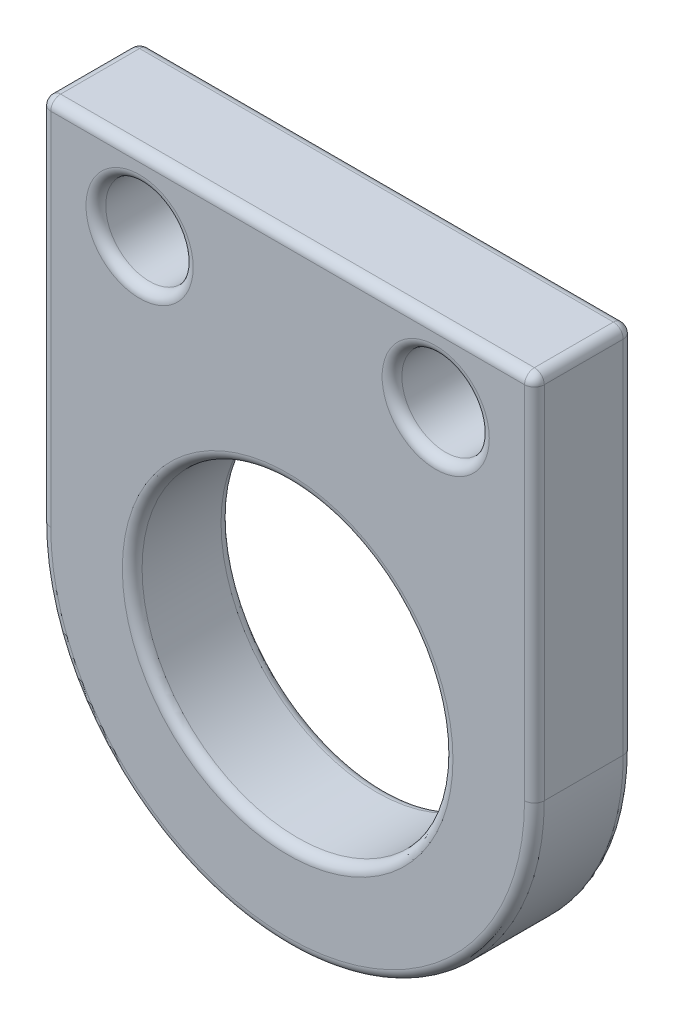
ISO-10303-21;
HEADER;
FILE_DESCRIPTION(('STEP AP214'),'2;1');
FILE_NAME('part.step','',(''),(''),'','','');
FILE_SCHEMA(('AUTOMOTIVE_DESIGN { 1 0 10303 214 1 1 1 1 }'));
ENDSEC;
DATA;
#1=APPLICATION_CONTEXT('core data for automotive mechanical design processes');
#2=APPLICATION_PROTOCOL_DEFINITION('international standard','automotive_design',2000,#1);
#3=PRODUCT_CONTEXT('',#1,'mechanical');
#4=PRODUCT('Part','Part','',(#3));
#5=PRODUCT_RELATED_PRODUCT_CATEGORY('part','',(#4));
#6=PRODUCT_DEFINITION_FORMATION('','',#4);
#7=PRODUCT_DEFINITION_CONTEXT('part definition',#1,'design');
#8=PRODUCT_DEFINITION('design','',#6,#7);
#9=PRODUCT_DEFINITION_SHAPE('','',#8);
#10=(LENGTH_UNIT() NAMED_UNIT(*) SI_UNIT(.MILLI.,.METRE.));
#11=(NAMED_UNIT(*) PLANE_ANGLE_UNIT() SI_UNIT($,.RADIAN.));
#12=(NAMED_UNIT(*) SI_UNIT($,.STERADIAN.) SOLID_ANGLE_UNIT());
#13=UNCERTAINTY_MEASURE_WITH_UNIT(LENGTH_MEASURE(1.E-05),#10,'distance_accuracy_value','');
#14=(GEOMETRIC_REPRESENTATION_CONTEXT(3) GLOBAL_UNCERTAINTY_ASSIGNED_CONTEXT((#13)) GLOBAL_UNIT_ASSIGNED_CONTEXT((#10,
#11,#12)) REPRESENTATION_CONTEXT('',''));
#15=CARTESIAN_POINT('',(0.,0.,0.));
#16=DIRECTION('',(0.,0.,1.));
#17=DIRECTION('',(1.,0.,0.));
#18=AXIS2_PLACEMENT_3D('',#15,#16,#17);
#19=CARTESIAN_POINT('',(-2743.81641052747,-3469.16156066705,-5098.24265194393));
#20=DIRECTION('',(-1.,0.,0.));
#21=DIRECTION('',(0.,0.,1.));
#22=AXIS2_PLACEMENT_3D('',#19,#20,#21);
#23=PLANE('',#22);
#24=DIRECTION('',(0.,0.,-1.));
#25=VECTOR('',#24,1.);
#26=CARTESIAN_POINT('',(-2743.81641052747,-3459.89056066705,-5098.24265194393));
#27=LINE('',#26,#25);
#28=CARTESIAN_POINT('',(-2743.81641052747,-3459.89056066705,-5100.52865194393));
#29=VERTEX_POINT('',#28);
#30=CARTESIAN_POINT('',(-2743.81641052747,-3459.89056066705,-5098.49665194393));
#31=VERTEX_POINT('',#30);
#32=EDGE_CURVE('E129',#29,#31,#27,.F.);
#33=ORIENTED_EDGE('',*,*,#32,.T.);
#34=DIRECTION('',(0.,1.,0.));
#35=VECTOR('',#34,1.);
#36=CARTESIAN_POINT('',(-2743.81641052747,-3469.16156066705,-5098.49665194393));
#37=LINE('',#36,#35);
#38=CARTESIAN_POINT('',(-2743.81641052747,-3469.16156066705,-5098.49665194393));
#39=VERTEX_POINT('',#38);
#40=EDGE_CURVE('E173',#31,#39,#37,.F.);
#41=ORIENTED_EDGE('',*,*,#40,.T.);
#42=DIRECTION('',(0.,0.,-1.));
#43=VECTOR('',#42,1.);
#44=CARTESIAN_POINT('',(-2743.81641052747,-3469.16156066705,-5098.24265194393));
#45=LINE('',#44,#43);
#46=CARTESIAN_POINT('',(-2743.81641052747,-3469.16156066705,-5100.52865194393));
#47=VERTEX_POINT('',#46);
#48=EDGE_CURVE('E307',#39,#47,#45,.T.);
#49=ORIENTED_EDGE('',*,*,#48,.T.);
#50=DIRECTION('',(0.,1.,0.));
#51=VECTOR('',#50,1.);
#52=CARTESIAN_POINT('',(-2743.81641052747,-3469.16156066705,-5100.52865194393));
#53=LINE('',#52,#51);
#54=EDGE_CURVE('E165',#47,#29,#53,.T.);
#55=ORIENTED_EDGE('',*,*,#54,.T.);
#56=EDGE_LOOP('',(#33,#41,#49,#55));
#57=FACE_BOUND('',#56,.T.);
#58=ADVANCED_FACE('F45',(#57),#23,.F.);
#59=CARTESIAN_POINT('',(-2756.51641052747,-3459.63656066705,-5098.24265194393));
#60=DIRECTION('',(0.,-1.,0.));
#61=DIRECTION('',(0.,0.,-1.));
#62=AXIS2_PLACEMENT_3D('',#59,#60,#61);
#63=PLANE('',#62);
#64=DIRECTION('',(0.,0.,-1.));
#65=VECTOR('',#64,1.);
#66=CARTESIAN_POINT('',(-2756.26241052747,-3459.63656066705,-5098.24265194393));
#67=LINE('',#66,#65);
#68=CARTESIAN_POINT('',(-2756.26241052747,-3459.63656066705,-5100.52865194393));
#69=VERTEX_POINT('',#68);
#70=CARTESIAN_POINT('',(-2756.26241052747,-3459.63656066705,-5098.49665194393));
#71=VERTEX_POINT('',#70);
#72=EDGE_CURVE('E154',#69,#71,#67,.F.);
#73=ORIENTED_EDGE('',*,*,#72,.T.);
#74=DIRECTION('',(-1.,0.,0.));
#75=VECTOR('',#74,1.);
#76=CARTESIAN_POINT('',(-2743.81641052747,-3459.63656066705,-5098.49665194393));
#77=LINE('',#76,#75);
#78=CARTESIAN_POINT('',(-2744.07041052747,-3459.63656066705,-5098.49665194393));
#79=VERTEX_POINT('',#78);
#80=EDGE_CURVE('E159',#71,#79,#77,.F.);
#81=ORIENTED_EDGE('',*,*,#80,.T.);
#82=DIRECTION('',(0.,0.,-1.));
#83=VECTOR('',#82,1.);
#84=CARTESIAN_POINT('',(-2744.07041052747,-3459.63656066705,-5098.24265194393));
#85=LINE('',#84,#83);
#86=CARTESIAN_POINT('',(-2744.07041052747,-3459.63656066705,-5100.52865194393));
#87=VERTEX_POINT('',#86);
#88=EDGE_CURVE('E127',#79,#87,#85,.T.);
#89=ORIENTED_EDGE('',*,*,#88,.T.);
#90=DIRECTION('',(-1.,0.,0.));
#91=VECTOR('',#90,1.);
#92=CARTESIAN_POINT('',(-2756.51641052747,-3459.63656066705,-5100.52865194393));
#93=LINE('',#92,#91);
#94=EDGE_CURVE('E147',#87,#69,#93,.T.);
#95=ORIENTED_EDGE('',*,*,#94,.T.);
#96=EDGE_LOOP('',(#73,#81,#89,#95));
#97=FACE_BOUND('',#96,.T.);
#98=ADVANCED_FACE('F157',(#97),#63,.F.);
#99=CARTESIAN_POINT('',(-2756.51641052747,-3469.16156066705,-5098.24265194393));
#100=DIRECTION('',(1.,0.,0.));
#101=DIRECTION('',(0.,0.,-1.));
#102=AXIS2_PLACEMENT_3D('',#99,#100,#101);
#103=PLANE('',#102);
#104=DIRECTION('',(0.,0.,-1.));
#105=VECTOR('',#104,1.);
#106=CARTESIAN_POINT('',(-2756.51641052747,-3469.16156066705,-5098.24265194393));
#107=LINE('',#106,#105);
#108=CARTESIAN_POINT('',(-2756.51641052747,-3469.16156066705,-5098.49665194393));
#109=VERTEX_POINT('',#108);
#110=CARTESIAN_POINT('',(-2756.51641052747,-3469.16156066705,-5100.52865194393));
#111=VERTEX_POINT('',#110);
#112=EDGE_CURVE('E155',#109,#111,#107,.T.);
#113=ORIENTED_EDGE('',*,*,#112,.F.);
#114=DIRECTION('',(0.,-1.,0.));
#115=VECTOR('',#114,1.);
#116=CARTESIAN_POINT('',(-2756.51641052747,-3459.63656066705,-5098.49665194393));
#117=LINE('',#116,#115);
#118=CARTESIAN_POINT('',(-2756.51641052747,-3459.89056066705,-5098.49665194393));
#119=VERTEX_POINT('',#118);
#120=EDGE_CURVE('E182',#109,#119,#117,.F.);
#121=ORIENTED_EDGE('',*,*,#120,.T.);
#122=DIRECTION('',(0.,0.,-1.));
#123=VECTOR('',#122,1.);
#124=CARTESIAN_POINT('',(-2756.51641052747,-3459.89056066705,-5098.24265194393));
#125=LINE('',#124,#123);
#126=CARTESIAN_POINT('',(-2756.51641052747,-3459.89056066705,-5100.52865194393));
#127=VERTEX_POINT('',#126);
#128=EDGE_CURVE('E179',#119,#127,#125,.T.);
#129=ORIENTED_EDGE('',*,*,#128,.T.);
#130=DIRECTION('',(0.,-1.,0.));
#131=VECTOR('',#130,1.);
#132=CARTESIAN_POINT('',(-2756.51641052747,-3469.16156066705,-5100.52865194393));
#133=LINE('',#132,#131);
#134=EDGE_CURVE('E176',#127,#111,#133,.T.);
#135=ORIENTED_EDGE('',*,*,#134,.T.);
#136=EDGE_LOOP('',(#113,#121,#129,#135));
#137=FACE_BOUND('',#136,.T.);
#138=ADVANCED_FACE('F358',(#137),#103,.F.);
#139=CARTESIAN_POINT('',(-2750.16641052747,-3469.16156066705,-5098.24265194393));
#140=DIRECTION('',(0.,0.,-1.));
#141=DIRECTION('',(-1.,0.,0.));
#142=AXIS2_PLACEMENT_3D('',#139,#140,#141);
#143=CYLINDRICAL_SURFACE('',#142,6.34999999999986);
#144=ORIENTED_EDGE('',*,*,#48,.F.);
#145=CARTESIAN_POINT('',(-2750.16641052747,-3469.16156066705,-5098.49665194393));
#146=DIRECTION('',(0.,0.,1.));
#147=DIRECTION('',(1.,0.,0.));
#148=AXIS2_PLACEMENT_3D('',#145,#146,#147);
#149=CIRCLE('',#148,6.34999999999986);
#150=EDGE_CURVE('E213',#39,#109,#149,.F.);
#151=ORIENTED_EDGE('',*,*,#150,.T.);
#152=ORIENTED_EDGE('',*,*,#112,.T.);
#153=CARTESIAN_POINT('',(-2750.16641052747,-3469.16156066705,-5100.52865194393));
#154=DIRECTION('',(0.,0.,1.));
#155=DIRECTION('',(1.,0.,0.));
#156=AXIS2_PLACEMENT_3D('',#153,#154,#155);
#157=CIRCLE('',#156,6.34999999999986);
#158=EDGE_CURVE('E210',#111,#47,#157,.T.);
#159=ORIENTED_EDGE('',*,*,#158,.T.);
#160=EDGE_LOOP('',(#144,#151,#152,#159));
#161=FACE_BOUND('',#160,.T.);
#162=ADVANCED_FACE('F324',(#161),#143,.T.);
#163=CARTESIAN_POINT('',(-2750.16641052747,-3469.16156066705,-5098.24265194393));
#164=DIRECTION('',(0.,0.,1.));
#165=DIRECTION('',(1.,0.,0.));
#166=AXIS2_PLACEMENT_3D('',#163,#164,#165);
#167=PLANE('',#166);
#168=DIRECTION('',(0.,-1.,0.));
#169=VECTOR('',#168,1.);
#170=CARTESIAN_POINT('',(-2756.26241052747,-3469.16156066705,-5098.24265194393));
#171=LINE('',#170,#169);
#172=CARTESIAN_POINT('',(-2756.26241052747,-3459.89056066705,-5098.24265194393));
#173=VERTEX_POINT('',#172);
#174=CARTESIAN_POINT('',(-2756.26241052747,-3469.16156066705,-5098.24265194393));
#175=VERTEX_POINT('',#174);
#176=EDGE_CURVE('E203',#173,#175,#171,.T.);
#177=ORIENTED_EDGE('',*,*,#176,.T.);
#178=CARTESIAN_POINT('',(-2750.16641052747,-3469.16156066705,-5098.24265194393));
#179=DIRECTION('',(0.,0.,1.));
#180=DIRECTION('',(1.,0.,0.));
#181=AXIS2_PLACEMENT_3D('',#178,#179,#180);
#182=CIRCLE('',#181,6.09599999999986);
#183=CARTESIAN_POINT('',(-2744.07041052747,-3469.16156066705,-5098.24265194393));
#184=VERTEX_POINT('',#183);
#185=EDGE_CURVE('E206',#175,#184,#182,.T.);
#186=ORIENTED_EDGE('',*,*,#185,.T.);
#187=DIRECTION('',(0.,1.,0.));
#188=VECTOR('',#187,1.);
#189=CARTESIAN_POINT('',(-2744.07041052747,-3459.63656066705,-5098.24265194393));
#190=LINE('',#189,#188);
#191=CARTESIAN_POINT('',(-2744.07041052747,-3459.89056066705,-5098.24265194393));
#192=VERTEX_POINT('',#191);
#193=EDGE_CURVE('E197',#184,#192,#190,.T.);
#194=ORIENTED_EDGE('',*,*,#193,.T.);
#195=DIRECTION('',(-1.,0.,0.));
#196=VECTOR('',#195,1.);
#197=CARTESIAN_POINT('',(-2756.51641052747,-3459.89056066705,-5098.24265194393));
#198=LINE('',#197,#196);
#199=EDGE_CURVE('E200',#192,#173,#198,.T.);
#200=ORIENTED_EDGE('',*,*,#199,.T.);
#201=EDGE_LOOP('',(#177,#186,#194,#200));
#202=FACE_BOUND('',#201,.T.);
#203=CARTESIAN_POINT('',(-2753.97641052747,-3461.54156066705,-5098.24265194393));
#204=DIRECTION('',(0.,0.,1.));
#205=DIRECTION('',(1.,0.,0.));
#206=AXIS2_PLACEMENT_3D('',#203,#204,#205);
#207=CIRCLE('',#206,1.37900003600018);
#208=CARTESIAN_POINT('',(-2752.59741049147,-3461.54156066705,-5098.24265194393));
#209=VERTEX_POINT('',#208);
#210=EDGE_CURVE('E193',#209,#209,#207,.F.);
#211=ORIENTED_EDGE('',*,*,#210,.T.);
#212=EDGE_LOOP('',(#211));
#213=FACE_BOUND('',#212,.T.);
#214=CARTESIAN_POINT('',(-2746.35641052747,-3461.54156066705,-5098.24265194393));
#215=DIRECTION('',(0.,0.,1.));
#216=DIRECTION('',(1.,0.,0.));
#217=AXIS2_PLACEMENT_3D('',#214,#215,#216);
#218=CIRCLE('',#217,1.37900000000003);
#219=CARTESIAN_POINT('',(-2744.97741052747,-3461.54156066705,-5098.24265194393));
#220=VERTEX_POINT('',#219);
#221=EDGE_CURVE('E189',#220,#220,#218,.F.);
#222=ORIENTED_EDGE('',*,*,#221,.T.);
#223=EDGE_LOOP('',(#222));
#224=FACE_BOUND('',#223,.T.);
#225=CARTESIAN_POINT('',(-2750.16641052747,-3469.16156066705,-5098.24265194393));
#226=DIRECTION('',(0.,0.,1.));
#227=DIRECTION('',(1.,0.,0.));
#228=AXIS2_PLACEMENT_3D('',#225,#226,#227);
#229=CIRCLE('',#228,4.25400000000021);
#230=CARTESIAN_POINT('',(-2745.91241052747,-3469.16156066705,-5098.24265194393));
#231=VERTEX_POINT('',#230);
#232=EDGE_CURVE('E185',#231,#231,#229,.F.);
#233=ORIENTED_EDGE('',*,*,#232,.T.);
#234=EDGE_LOOP('',(#233));
#235=FACE_BOUND('',#234,.T.);
#236=ADVANCED_FACE('F345',(#202,#213,#224,#235),#167,.T.);
#237=CARTESIAN_POINT('',(-2750.16641052747,-3469.16156066705,-5100.78265194393));
#238=DIRECTION('',(0.,0.,1.));
#239=DIRECTION('',(1.,0.,0.));
#240=AXIS2_PLACEMENT_3D('',#237,#238,#239);
#241=PLANE('',#240);
#242=DIRECTION('',(0.,-1.,0.));
#243=VECTOR('',#242,1.);
#244=CARTESIAN_POINT('',(-2756.26241052747,-3469.16156066705,-5100.78265194393));
#245=LINE('',#244,#243);
#246=CARTESIAN_POINT('',(-2756.26241052747,-3469.16156066705,-5100.78265194393));
#247=VERTEX_POINT('',#246);
#248=CARTESIAN_POINT('',(-2756.26241052747,-3459.89056066705,-5100.78265194393));
#249=VERTEX_POINT('',#248);
#250=EDGE_CURVE('E55',#247,#249,#245,.F.);
#251=ORIENTED_EDGE('',*,*,#250,.T.);
#252=DIRECTION('',(-1.,0.,0.));
#253=VECTOR('',#252,1.);
#254=CARTESIAN_POINT('',(-2750.16641052747,-3459.89056066705,-5100.78265194393));
#255=LINE('',#254,#253);
#256=CARTESIAN_POINT('',(-2744.07041052747,-3459.89056066705,-5100.78265194393));
#257=VERTEX_POINT('',#256);
#258=EDGE_CURVE('E11',#249,#257,#255,.F.);
#259=ORIENTED_EDGE('',*,*,#258,.T.);
#260=DIRECTION('',(0.,1.,0.));
#261=VECTOR('',#260,1.);
#262=CARTESIAN_POINT('',(-2744.07041052747,-3469.16156066705,-5100.78265194393));
#263=LINE('',#262,#261);
#264=CARTESIAN_POINT('',(-2744.07041052747,-3469.16156066705,-5100.78265194393));
#265=VERTEX_POINT('',#264);
#266=EDGE_CURVE('E252',#257,#265,#263,.F.);
#267=ORIENTED_EDGE('',*,*,#266,.T.);
#268=CARTESIAN_POINT('',(-2750.16641052747,-3469.16156066705,-5100.78265194393));
#269=DIRECTION('',(0.,0.,1.));
#270=DIRECTION('',(1.,0.,0.));
#271=AXIS2_PLACEMENT_3D('',#268,#269,#270);
#272=CIRCLE('',#271,6.09599999999986);
#273=EDGE_CURVE('E66',#265,#247,#272,.F.);
#274=ORIENTED_EDGE('',*,*,#273,.T.);
#275=EDGE_LOOP('',(#251,#259,#267,#274));
#276=FACE_BOUND('',#275,.T.);
#277=CARTESIAN_POINT('',(-2753.97641052747,-3461.54156066705,-5100.78265194393));
#278=DIRECTION('',(0.,0.,1.));
#279=DIRECTION('',(1.,0.,0.));
#280=AXIS2_PLACEMENT_3D('',#277,#278,#279);
#281=CIRCLE('',#280,1.37900003600018);
#282=CARTESIAN_POINT('',(-2752.59741049147,-3461.54156066705,-5100.78265194393));
#283=VERTEX_POINT('',#282);
#284=EDGE_CURVE('E248',#283,#283,#281,.T.);
#285=ORIENTED_EDGE('',*,*,#284,.T.);
#286=EDGE_LOOP('',(#285));
#287=FACE_BOUND('',#286,.T.);
#288=CARTESIAN_POINT('',(-2746.35641052747,-3461.54156066705,-5100.78265194393));
#289=DIRECTION('',(0.,0.,1.));
#290=DIRECTION('',(1.,0.,0.));
#291=AXIS2_PLACEMENT_3D('',#288,#289,#290);
#292=CIRCLE('',#291,1.37900000000003);
#293=CARTESIAN_POINT('',(-2744.97741052747,-3461.54156066705,-5100.78265194393));
#294=VERTEX_POINT('',#293);
#295=EDGE_CURVE('E244',#294,#294,#292,.T.);
#296=ORIENTED_EDGE('',*,*,#295,.T.);
#297=EDGE_LOOP('',(#296));
#298=FACE_BOUND('',#297,.T.);
#299=CARTESIAN_POINT('',(-2750.16641052747,-3469.16156066705,-5100.78265194393));
#300=DIRECTION('',(0.,0.,1.));
#301=DIRECTION('',(1.,0.,0.));
#302=AXIS2_PLACEMENT_3D('',#299,#300,#301);
#303=CIRCLE('',#302,4.25400000000021);
#304=CARTESIAN_POINT('',(-2745.91241052747,-3469.16156066705,-5100.78265194393));
#305=VERTEX_POINT('',#304);
#306=EDGE_CURVE('E240',#305,#305,#303,.T.);
#307=ORIENTED_EDGE('',*,*,#306,.T.);
#308=EDGE_LOOP('',(#307));
#309=FACE_BOUND('',#308,.T.);
#310=ADVANCED_FACE('F442',(#276,#287,#298,#309),#241,.F.);
#311=CARTESIAN_POINT('',(-2753.97641052747,-3461.54156066705,-5100.78365194393));
#312=DIRECTION('',(0.,0.,1.));
#313=DIRECTION('',(1.,0.,0.));
#314=AXIS2_PLACEMENT_3D('',#311,#312,#313);
#315=CYLINDRICAL_SURFACE('',#314,1.12500003600018);
#316=CARTESIAN_POINT('',(-2753.97641052747,-3461.54156066705,-5098.49665194393));
#317=DIRECTION('',(0.,0.,1.));
#318=DIRECTION('',(1.,0.,0.));
#319=AXIS2_PLACEMENT_3D('',#316,#317,#318);
#320=CIRCLE('',#319,1.12500003600018);
#321=CARTESIAN_POINT('',(-2752.85141049147,-3461.54156066705,-5098.49665194393));
#322=VERTEX_POINT('',#321);
#323=EDGE_CURVE('E220',#322,#322,#320,.T.);
#324=ORIENTED_EDGE('',*,*,#323,.T.);
#325=EDGE_LOOP('',(#324));
#326=FACE_BOUND('',#325,.T.);
#327=CARTESIAN_POINT('',(-2753.97641052747,-3461.54156066705,-5100.52865194393));
#328=DIRECTION('',(0.,0.,1.));
#329=DIRECTION('',(1.,0.,0.));
#330=AXIS2_PLACEMENT_3D('',#327,#328,#329);
#331=CIRCLE('',#330,1.12500003600018);
#332=CARTESIAN_POINT('',(-2752.85141049147,-3461.54156066705,-5100.52865194393));
#333=VERTEX_POINT('',#332);
#334=EDGE_CURVE('E216',#333,#333,#331,.F.);
#335=ORIENTED_EDGE('',*,*,#334,.T.);
#336=EDGE_LOOP('',(#335));
#337=FACE_BOUND('',#336,.T.);
#338=ADVANCED_FACE('F433',(#326,#337),#315,.F.);
#339=CARTESIAN_POINT('',(-2746.35641052747,-3461.54156066705,-5100.78365194393));
#340=DIRECTION('',(0.,0.,1.));
#341=DIRECTION('',(1.,0.,0.));
#342=AXIS2_PLACEMENT_3D('',#339,#340,#341);
#343=CYLINDRICAL_SURFACE('',#342,1.12500000000003);
#344=CARTESIAN_POINT('',(-2746.35641052747,-3461.54156066705,-5098.49665194393));
#345=DIRECTION('',(0.,0.,1.));
#346=DIRECTION('',(1.,0.,0.));
#347=AXIS2_PLACEMENT_3D('',#344,#345,#346);
#348=CIRCLE('',#347,1.12500000000003);
#349=CARTESIAN_POINT('',(-2745.23141052747,-3461.54156066705,-5098.49665194393));
#350=VERTEX_POINT('',#349);
#351=EDGE_CURVE('E228',#350,#350,#348,.T.);
#352=ORIENTED_EDGE('',*,*,#351,.T.);
#353=EDGE_LOOP('',(#352));
#354=FACE_BOUND('',#353,.T.);
#355=CARTESIAN_POINT('',(-2746.35641052747,-3461.54156066705,-5100.52865194393));
#356=DIRECTION('',(0.,0.,1.));
#357=DIRECTION('',(1.,0.,0.));
#358=AXIS2_PLACEMENT_3D('',#355,#356,#357);
#359=CIRCLE('',#358,1.12500000000003);
#360=CARTESIAN_POINT('',(-2745.23141052747,-3461.54156066705,-5100.52865194393));
#361=VERTEX_POINT('',#360);
#362=EDGE_CURVE('E224',#361,#361,#359,.F.);
#363=ORIENTED_EDGE('',*,*,#362,.T.);
#364=EDGE_LOOP('',(#363));
#365=FACE_BOUND('',#364,.T.);
#366=ADVANCED_FACE('F431',(#354,#365),#343,.F.);
#367=CARTESIAN_POINT('',(-2750.16641052747,-3469.16156066705,-5100.78365194393));
#368=DIRECTION('',(0.,0.,1.));
#369=DIRECTION('',(1.,0.,0.));
#370=AXIS2_PLACEMENT_3D('',#367,#368,#369);
#371=CYLINDRICAL_SURFACE('',#370,4.00000000000021);
#372=CARTESIAN_POINT('',(-2750.16641052747,-3469.16156066705,-5098.49665194393));
#373=DIRECTION('',(0.,0.,1.));
#374=DIRECTION('',(1.,0.,0.));
#375=AXIS2_PLACEMENT_3D('',#372,#373,#374);
#376=CIRCLE('',#375,4.00000000000021);
#377=CARTESIAN_POINT('',(-2746.16641052747,-3469.16156066705,-5098.49665194393));
#378=VERTEX_POINT('',#377);
#379=EDGE_CURVE('E236',#378,#378,#376,.T.);
#380=ORIENTED_EDGE('',*,*,#379,.T.);
#381=EDGE_LOOP('',(#380));
#382=FACE_BOUND('',#381,.T.);
#383=CARTESIAN_POINT('',(-2750.16641052747,-3469.16156066705,-5100.52865194393));
#384=DIRECTION('',(0.,0.,1.));
#385=DIRECTION('',(1.,0.,0.));
#386=AXIS2_PLACEMENT_3D('',#383,#384,#385);
#387=CIRCLE('',#386,4.00000000000021);
#388=CARTESIAN_POINT('',(-2746.16641052747,-3469.16156066705,-5100.52865194393));
#389=VERTEX_POINT('',#388);
#390=EDGE_CURVE('E232',#389,#389,#387,.F.);
#391=ORIENTED_EDGE('',*,*,#390,.T.);
#392=EDGE_LOOP('',(#391));
#393=FACE_BOUND('',#392,.T.);
#394=ADVANCED_FACE('F405',(#382,#393),#371,.F.);
#395=CARTESIAN_POINT('',(-2756.26241052747,-3469.16156066705,-5098.49665194393));
#396=DIRECTION('',(0.,1.,0.));
#397=DIRECTION('',(0.,0.,1.));
#398=AXIS2_PLACEMENT_3D('',#395,#396,#397);
#399=CYLINDRICAL_SURFACE('',#398,0.254);
#400=CARTESIAN_POINT('',(-2756.26241052747,-3459.89056066705,-5098.49665194393));
#401=DIRECTION('',(0.,1.,0.));
#402=DIRECTION('',(0.,0.,1.));
#403=AXIS2_PLACEMENT_3D('',#400,#401,#402);
#404=CIRCLE('',#403,0.254);
#405=EDGE_CURVE('E299',#119,#173,#404,.T.);
#406=ORIENTED_EDGE('',*,*,#405,.F.);
#407=ORIENTED_EDGE('',*,*,#120,.F.);
#408=CARTESIAN_POINT('',(-2756.26241052747,-3469.16156066705,-5098.49665194393));
#409=DIRECTION('',(0.,-1.,0.));
#410=DIRECTION('',(0.,0.,-1.));
#411=AXIS2_PLACEMENT_3D('',#408,#409,#410);
#412=CIRCLE('',#411,0.254);
#413=EDGE_CURVE('E49',#175,#109,#412,.T.);
#414=ORIENTED_EDGE('',*,*,#413,.F.);
#415=ORIENTED_EDGE('',*,*,#176,.F.);
#416=EDGE_LOOP('',(#406,#407,#414,#415));
#417=FACE_BOUND('',#416,.T.);
#418=ADVANCED_FACE('F357',(#417),#399,.T.);
#419=CARTESIAN_POINT('',(-2756.26241052747,-3459.89056066705,-5098.24265194393));
#420=DIRECTION('',(0.,0.,-1.));
#421=DIRECTION('',(-1.,0.,0.));
#422=AXIS2_PLACEMENT_3D('',#419,#420,#421);
#423=CYLINDRICAL_SURFACE('',#422,0.254);
#424=CARTESIAN_POINT('',(-2756.26241052747,-3459.89056066705,-5100.52865194393));
#425=DIRECTION('',(0.,0.,-1.));
#426=DIRECTION('',(-1.,0.,0.));
#427=AXIS2_PLACEMENT_3D('',#424,#425,#426);
#428=CIRCLE('',#427,0.254);
#429=EDGE_CURVE('E292',#127,#69,#428,.T.);
#430=ORIENTED_EDGE('',*,*,#429,.F.);
#431=ORIENTED_EDGE('',*,*,#128,.F.);
#432=CARTESIAN_POINT('',(-2756.26241052747,-3459.89056066705,-5098.49665194393));
#433=DIRECTION('',(0.,0.,1.));
#434=DIRECTION('',(1.,0.,0.));
#435=AXIS2_PLACEMENT_3D('',#432,#433,#434);
#436=CIRCLE('',#435,0.254);
#437=EDGE_CURVE('E296',#71,#119,#436,.T.);
#438=ORIENTED_EDGE('',*,*,#437,.F.);
#439=ORIENTED_EDGE('',*,*,#72,.F.);
#440=EDGE_LOOP('',(#430,#431,#438,#439));
#441=FACE_BOUND('',#440,.T.);
#442=ADVANCED_FACE('F355',(#441),#423,.T.);
#443=CARTESIAN_POINT('',(-2756.26241052747,-3469.16156066705,-5100.52865194393));
#444=DIRECTION('',(0.,-1.,0.));
#445=DIRECTION('',(0.,0.,-1.));
#446=AXIS2_PLACEMENT_3D('',#443,#444,#445);
#447=CYLINDRICAL_SURFACE('',#446,0.254);
#448=CARTESIAN_POINT('',(-2756.26241052747,-3469.16156066705,-5100.52865194393));
#449=DIRECTION('',(0.,-1.,0.));
#450=DIRECTION('',(0.,0.,-1.));
#451=AXIS2_PLACEMENT_3D('',#448,#449,#450);
#452=CIRCLE('',#451,0.254);
#453=EDGE_CURVE('E284',#111,#247,#452,.T.);
#454=ORIENTED_EDGE('',*,*,#453,.F.);
#455=ORIENTED_EDGE('',*,*,#134,.F.);
#456=CARTESIAN_POINT('',(-2756.26241052747,-3459.89056066705,-5100.52865194393));
#457=DIRECTION('',(0.,1.,0.));
#458=DIRECTION('',(0.,0.,1.));
#459=AXIS2_PLACEMENT_3D('',#456,#457,#458);
#460=CIRCLE('',#459,0.254);
#461=EDGE_CURVE('E288',#249,#127,#460,.T.);
#462=ORIENTED_EDGE('',*,*,#461,.F.);
#463=ORIENTED_EDGE('',*,*,#250,.F.);
#464=EDGE_LOOP('',(#454,#455,#462,#463));
#465=FACE_BOUND('',#464,.T.);
#466=ADVANCED_FACE('F330',(#465),#447,.T.);
#467=CARTESIAN_POINT('',(-2750.16641052747,-3469.16156066705,-5098.49665194393));
#468=DIRECTION('',(0.,0.,1.));
#469=DIRECTION('',(1.,0.,0.));
#470=AXIS2_PLACEMENT_3D('',#467,#468,#469);
#471=TOROIDAL_SURFACE('',#470,6.09599999999986,0.254);
#472=ORIENTED_EDGE('',*,*,#413,.T.);
#473=ORIENTED_EDGE('',*,*,#150,.F.);
#474=CARTESIAN_POINT('',(-2744.07041052747,-3469.16156066705,-5098.49665194393));
#475=DIRECTION('',(0.,1.,0.));
#476=DIRECTION('',(0.,0.,1.));
#477=AXIS2_PLACEMENT_3D('',#474,#475,#476);
#478=CIRCLE('',#477,0.254);
#479=EDGE_CURVE('E280',#184,#39,#478,.T.);
#480=ORIENTED_EDGE('',*,*,#479,.F.);
#481=ORIENTED_EDGE('',*,*,#185,.F.);
#482=EDGE_LOOP('',(#472,#473,#480,#481));
#483=FACE_BOUND('',#482,.T.);
#484=ADVANCED_FACE('F341',(#483),#471,.T.);
#485=CARTESIAN_POINT('',(-2756.26241052747,-3459.89056066705,-5098.49665194393));
#486=DIRECTION('',(-1.,0.,0.));
#487=DIRECTION('',(0.,0.,1.));
#488=AXIS2_PLACEMENT_3D('',#485,#486,#487);
#489=SPHERICAL_SURFACE('',#488,0.254);
#490=ORIENTED_EDGE('',*,*,#437,.T.);
#491=ORIENTED_EDGE('',*,*,#405,.T.);
#492=CARTESIAN_POINT('',(-2756.26241052747,-3459.89056066705,-5098.49665194393));
#493=DIRECTION('',(-1.,0.,0.));
#494=DIRECTION('',(0.,0.,1.));
#495=AXIS2_PLACEMENT_3D('',#492,#493,#494);
#496=CIRCLE('',#495,0.254);
#497=EDGE_CURVE('E276',#71,#173,#496,.F.);
#498=ORIENTED_EDGE('',*,*,#497,.F.);
#499=EDGE_LOOP('',(#490,#491,#498));
#500=FACE_BOUND('',#499,.T.);
#501=ADVANCED_FACE('F351',(#500),#489,.T.);
#502=CARTESIAN_POINT('',(-2756.26241052747,-3459.89056066705,-5100.52865194393));
#503=DIRECTION('',(-1.,0.,0.));
#504=DIRECTION('',(0.,0.,1.));
#505=AXIS2_PLACEMENT_3D('',#502,#503,#504);
#506=SPHERICAL_SURFACE('',#505,0.254);
#507=ORIENTED_EDGE('',*,*,#461,.T.);
#508=ORIENTED_EDGE('',*,*,#429,.T.);
#509=CARTESIAN_POINT('',(-2756.26241052747,-3459.89056066705,-5100.52865194393));
#510=DIRECTION('',(-1.,0.,0.));
#511=DIRECTION('',(0.,0.,1.));
#512=AXIS2_PLACEMENT_3D('',#509,#510,#511);
#513=CIRCLE('',#512,0.254);
#514=EDGE_CURVE('E150',#249,#69,#513,.F.);
#515=ORIENTED_EDGE('',*,*,#514,.F.);
#516=EDGE_LOOP('',(#507,#508,#515));
#517=FACE_BOUND('',#516,.T.);
#518=ADVANCED_FACE('F391',(#517),#506,.T.);
#519=CARTESIAN_POINT('',(-2750.16641052747,-3469.16156066705,-5100.52865194393));
#520=DIRECTION('',(0.,0.,1.));
#521=DIRECTION('',(1.,0.,0.));
#522=AXIS2_PLACEMENT_3D('',#519,#520,#521);
#523=TOROIDAL_SURFACE('',#522,6.09599999999986,0.254);
#524=ORIENTED_EDGE('',*,*,#453,.T.);
#525=ORIENTED_EDGE('',*,*,#273,.F.);
#526=CARTESIAN_POINT('',(-2744.07041052747,-3469.16156066705,-5100.52865194393));
#527=DIRECTION('',(0.,1.,0.));
#528=DIRECTION('',(0.,0.,1.));
#529=AXIS2_PLACEMENT_3D('',#526,#527,#528);
#530=CIRCLE('',#529,0.254);
#531=EDGE_CURVE('E270',#47,#265,#530,.T.);
#532=ORIENTED_EDGE('',*,*,#531,.F.);
#533=ORIENTED_EDGE('',*,*,#158,.F.);
#534=EDGE_LOOP('',(#524,#525,#532,#533));
#535=FACE_BOUND('',#534,.T.);
#536=ADVANCED_FACE('F333',(#535),#523,.T.);
#537=CARTESIAN_POINT('',(-2744.07041052747,-3469.16156066705,-5098.49665194393));
#538=DIRECTION('',(0.,-1.,0.));
#539=DIRECTION('',(0.,0.,-1.));
#540=AXIS2_PLACEMENT_3D('',#537,#538,#539);
#541=CYLINDRICAL_SURFACE('',#540,0.254);
#542=ORIENTED_EDGE('',*,*,#479,.T.);
#543=ORIENTED_EDGE('',*,*,#40,.F.);
#544=CARTESIAN_POINT('',(-2744.07041052747,-3459.89056066705,-5098.49665194393));
#545=DIRECTION('',(0.,1.,0.));
#546=DIRECTION('',(0.,0.,1.));
#547=AXIS2_PLACEMENT_3D('',#544,#545,#546);
#548=CIRCLE('',#547,0.254);
#549=EDGE_CURVE('E266',#192,#31,#548,.T.);
#550=ORIENTED_EDGE('',*,*,#549,.F.);
#551=ORIENTED_EDGE('',*,*,#193,.F.);
#552=EDGE_LOOP('',(#542,#543,#550,#551));
#553=FACE_BOUND('',#552,.T.);
#554=ADVANCED_FACE('F342',(#553),#541,.T.);
#555=CARTESIAN_POINT('',(-2750.16641052747,-3459.89056066705,-5098.49665194393));
#556=DIRECTION('',(1.,0.,0.));
#557=DIRECTION('',(0.,0.,-1.));
#558=AXIS2_PLACEMENT_3D('',#555,#556,#557);
#559=CYLINDRICAL_SURFACE('',#558,0.254);
#560=ORIENTED_EDGE('',*,*,#497,.T.);
#561=ORIENTED_EDGE('',*,*,#199,.F.);
#562=CARTESIAN_POINT('',(-2744.07041052747,-3459.89056066705,-5098.49665194393));
#563=DIRECTION('',(1.,0.,0.));
#564=DIRECTION('',(0.,0.,-1.));
#565=AXIS2_PLACEMENT_3D('',#562,#563,#564);
#566=CIRCLE('',#565,0.254);
#567=EDGE_CURVE('E144',#79,#192,#566,.T.);
#568=ORIENTED_EDGE('',*,*,#567,.F.);
#569=ORIENTED_EDGE('',*,*,#80,.F.);
#570=EDGE_LOOP('',(#560,#561,#568,#569));
#571=FACE_BOUND('',#570,.T.);
#572=ADVANCED_FACE('F349',(#571),#559,.T.);
#573=CARTESIAN_POINT('',(-2756.51641052747,-3459.89056066705,-5100.52865194393));
#574=DIRECTION('',(-1.,0.,0.));
#575=DIRECTION('',(0.,0.,1.));
#576=AXIS2_PLACEMENT_3D('',#573,#574,#575);
#577=CYLINDRICAL_SURFACE('',#576,0.254);
#578=ORIENTED_EDGE('',*,*,#514,.T.);
#579=ORIENTED_EDGE('',*,*,#94,.F.);
#580=CARTESIAN_POINT('',(-2744.07041052747,-3459.89056066705,-5100.52865194393));
#581=DIRECTION('',(1.,0.,0.));
#582=DIRECTION('',(0.,0.,-1.));
#583=AXIS2_PLACEMENT_3D('',#580,#581,#582);
#584=CIRCLE('',#583,0.254);
#585=EDGE_CURVE('E135',#257,#87,#584,.T.);
#586=ORIENTED_EDGE('',*,*,#585,.F.);
#587=ORIENTED_EDGE('',*,*,#258,.F.);
#588=EDGE_LOOP('',(#578,#579,#586,#587));
#589=FACE_BOUND('',#588,.T.);
#590=ADVANCED_FACE('F148',(#589),#577,.T.);
#591=CARTESIAN_POINT('',(-2744.07041052747,-3469.16156066705,-5100.52865194393));
#592=DIRECTION('',(0.,1.,0.));
#593=DIRECTION('',(0.,0.,1.));
#594=AXIS2_PLACEMENT_3D('',#591,#592,#593);
#595=CYLINDRICAL_SURFACE('',#594,0.254);
#596=ORIENTED_EDGE('',*,*,#531,.T.);
#597=ORIENTED_EDGE('',*,*,#266,.F.);
#598=CARTESIAN_POINT('',(-2744.07041052747,-3459.89056066705,-5100.52865194393));
#599=DIRECTION('',(0.,1.,0.));
#600=DIRECTION('',(0.,0.,1.));
#601=AXIS2_PLACEMENT_3D('',#598,#599,#600);
#602=CIRCLE('',#601,0.254);
#603=EDGE_CURVE('E139',#29,#257,#602,.T.);
#604=ORIENTED_EDGE('',*,*,#603,.F.);
#605=ORIENTED_EDGE('',*,*,#54,.F.);
#606=EDGE_LOOP('',(#596,#597,#604,#605));
#607=FACE_BOUND('',#606,.T.);
#608=ADVANCED_FACE('F336',(#607),#595,.T.);
#609=CARTESIAN_POINT('',(-2744.07041052747,-3459.89056066705,-5098.49665194393));
#610=DIRECTION('',(0.,0.,1.));
#611=DIRECTION('',(1.,0.,0.));
#612=AXIS2_PLACEMENT_3D('',#609,#610,#611);
#613=SPHERICAL_SURFACE('',#612,0.254);
#614=ORIENTED_EDGE('',*,*,#567,.T.);
#615=ORIENTED_EDGE('',*,*,#549,.T.);
#616=CARTESIAN_POINT('',(-2744.07041052747,-3459.89056066705,-5098.49665194393));
#617=DIRECTION('',(0.,0.,1.));
#618=DIRECTION('',(1.,0.,0.));
#619=AXIS2_PLACEMENT_3D('',#616,#617,#618);
#620=CIRCLE('',#619,0.254);
#621=EDGE_CURVE('E132',#79,#31,#620,.F.);
#622=ORIENTED_EDGE('',*,*,#621,.F.);
#623=EDGE_LOOP('',(#614,#615,#622));
#624=FACE_BOUND('',#623,.T.);
#625=ADVANCED_FACE('F377',(#624),#613,.T.);
#626=CARTESIAN_POINT('',(-2744.07041052747,-3459.89056066705,-5100.52865194393));
#627=DIRECTION('',(0.,0.,-1.));
#628=DIRECTION('',(-1.,0.,0.));
#629=AXIS2_PLACEMENT_3D('',#626,#627,#628);
#630=SPHERICAL_SURFACE('',#629,0.254);
#631=ORIENTED_EDGE('',*,*,#603,.T.);
#632=ORIENTED_EDGE('',*,*,#585,.T.);
#633=CARTESIAN_POINT('',(-2744.07041052747,-3459.89056066705,-5100.52865194393));
#634=DIRECTION('',(0.,0.,-1.));
#635=DIRECTION('',(-1.,0.,0.));
#636=AXIS2_PLACEMENT_3D('',#633,#634,#635);
#637=CIRCLE('',#636,0.254);
#638=EDGE_CURVE('E123',#29,#87,#637,.F.);
#639=ORIENTED_EDGE('',*,*,#638,.F.);
#640=EDGE_LOOP('',(#631,#632,#639));
#641=FACE_BOUND('',#640,.T.);
#642=ADVANCED_FACE('F137',(#641),#630,.T.);
#643=CARTESIAN_POINT('',(-2744.07041052747,-3459.89056066705,-5098.24265194393));
#644=DIRECTION('',(0.,0.,-1.));
#645=DIRECTION('',(-1.,0.,0.));
#646=AXIS2_PLACEMENT_3D('',#643,#644,#645);
#647=CYLINDRICAL_SURFACE('',#646,0.254);
#648=ORIENTED_EDGE('',*,*,#621,.T.);
#649=ORIENTED_EDGE('',*,*,#32,.F.);
#650=ORIENTED_EDGE('',*,*,#638,.T.);
#651=ORIENTED_EDGE('',*,*,#88,.F.);
#652=EDGE_LOOP('',(#648,#649,#650,#651));
#653=FACE_BOUND('',#652,.T.);
#654=ADVANCED_FACE('F125',(#653),#647,.T.);
#655=CARTESIAN_POINT('',(-2753.97641052747,-3461.54156066705,-5098.49665194393));
#656=DIRECTION('',(0.,0.,1.));
#657=DIRECTION('',(1.,0.,0.));
#658=AXIS2_PLACEMENT_3D('',#655,#656,#657);
#659=TOROIDAL_SURFACE('',#658,1.37900003600018,0.254);
#660=ORIENTED_EDGE('',*,*,#210,.F.);
#661=EDGE_LOOP('',(#660));
#662=FACE_BOUND('',#661,.T.);
#663=ORIENTED_EDGE('',*,*,#323,.F.);
#664=EDGE_LOOP('',(#663));
#665=FACE_BOUND('',#664,.T.);
#666=ADVANCED_FACE('F374',(#662,#665),#659,.T.);
#667=CARTESIAN_POINT('',(-2746.35641052747,-3461.54156066705,-5098.49665194393));
#668=DIRECTION('',(0.,0.,1.));
#669=DIRECTION('',(1.,0.,0.));
#670=AXIS2_PLACEMENT_3D('',#667,#668,#669);
#671=TOROIDAL_SURFACE('',#670,1.37900000000003,0.254);
#672=ORIENTED_EDGE('',*,*,#221,.F.);
#673=EDGE_LOOP('',(#672));
#674=FACE_BOUND('',#673,.T.);
#675=ORIENTED_EDGE('',*,*,#351,.F.);
#676=EDGE_LOOP('',(#675));
#677=FACE_BOUND('',#676,.T.);
#678=ADVANCED_FACE('F408',(#674,#677),#671,.T.);
#679=CARTESIAN_POINT('',(-2750.16641052747,-3469.16156066705,-5098.49665194393));
#680=DIRECTION('',(0.,0.,1.));
#681=DIRECTION('',(1.,0.,0.));
#682=AXIS2_PLACEMENT_3D('',#679,#680,#681);
#683=TOROIDAL_SURFACE('',#682,4.25400000000021,0.254);
#684=ORIENTED_EDGE('',*,*,#232,.F.);
#685=EDGE_LOOP('',(#684));
#686=FACE_BOUND('',#685,.T.);
#687=ORIENTED_EDGE('',*,*,#379,.F.);
#688=EDGE_LOOP('',(#687));
#689=FACE_BOUND('',#688,.T.);
#690=ADVANCED_FACE('F412',(#686,#689),#683,.T.);
#691=CARTESIAN_POINT('',(-2753.97641052747,-3461.54156066705,-5100.52865194393));
#692=DIRECTION('',(0.,0.,1.));
#693=DIRECTION('',(1.,0.,0.));
#694=AXIS2_PLACEMENT_3D('',#691,#692,#693);
#695=TOROIDAL_SURFACE('',#694,1.37900003600018,0.254);
#696=ORIENTED_EDGE('',*,*,#284,.F.);
#697=EDGE_LOOP('',(#696));
#698=FACE_BOUND('',#697,.T.);
#699=ORIENTED_EDGE('',*,*,#334,.F.);
#700=EDGE_LOOP('',(#699));
#701=FACE_BOUND('',#700,.T.);
#702=ADVANCED_FACE('F416',(#698,#701),#695,.T.);
#703=CARTESIAN_POINT('',(-2746.35641052747,-3461.54156066705,-5100.52865194393));
#704=DIRECTION('',(0.,0.,1.));
#705=DIRECTION('',(1.,0.,0.));
#706=AXIS2_PLACEMENT_3D('',#703,#704,#705);
#707=TOROIDAL_SURFACE('',#706,1.37900000000003,0.254);
#708=ORIENTED_EDGE('',*,*,#295,.F.);
#709=EDGE_LOOP('',(#708));
#710=FACE_BOUND('',#709,.T.);
#711=ORIENTED_EDGE('',*,*,#362,.F.);
#712=EDGE_LOOP('',(#711));
#713=FACE_BOUND('',#712,.T.);
#714=ADVANCED_FACE('F419',(#710,#713),#707,.T.);
#715=CARTESIAN_POINT('',(-2750.16641052747,-3469.16156066705,-5100.52865194393));
#716=DIRECTION('',(0.,0.,1.));
#717=DIRECTION('',(1.,0.,0.));
#718=AXIS2_PLACEMENT_3D('',#715,#716,#717);
#719=TOROIDAL_SURFACE('',#718,4.25400000000021,0.254);
#720=ORIENTED_EDGE('',*,*,#306,.F.);
#721=EDGE_LOOP('',(#720));
#722=FACE_BOUND('',#721,.T.);
#723=ORIENTED_EDGE('',*,*,#390,.F.);
#724=EDGE_LOOP('',(#723));
#725=FACE_BOUND('',#724,.T.);
#726=ADVANCED_FACE('F47',(#722,#725),#719,.T.);
#727=CLOSED_SHELL('',(#58,#98,#138,#162,#236,#310,#338,#366,#394,#418,#442,#466,#484,#501,#518,
#536,#554,#572,#590,#608,#625,#642,#654,#666,#678,#690,#702,#714,#726));
#728=MANIFOLD_SOLID_BREP('B2',#727);
#729=ADVANCED_BREP_SHAPE_REPRESENTATION('',(#18,#728),#14);
#730=SHAPE_DEFINITION_REPRESENTATION(#9,#729);
ENDSEC;
END-ISO-10303-21;
